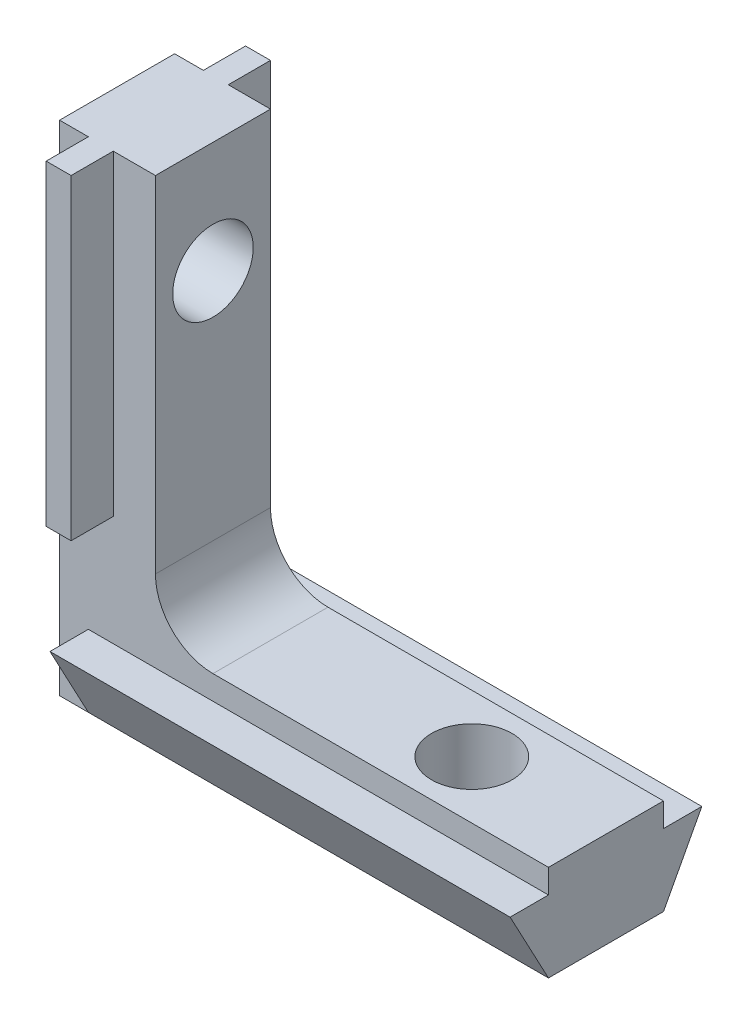
ISO-10303-21;
HEADER;
FILE_DESCRIPTION(('STEP AP214'),'2;1');
FILE_NAME('part.step','',(''),(''),'','','');
FILE_SCHEMA(('AUTOMOTIVE_DESIGN { 1 0 10303 214 1 1 1 1 }'));
ENDSEC;
DATA;
#1=APPLICATION_CONTEXT('core data for automotive mechanical design processes');
#2=APPLICATION_PROTOCOL_DEFINITION('international standard','automotive_design',2000,#1);
#3=PRODUCT_CONTEXT('',#1,'mechanical');
#4=PRODUCT('Part','Part','',(#3));
#5=PRODUCT_RELATED_PRODUCT_CATEGORY('part','',(#4));
#6=PRODUCT_DEFINITION_FORMATION('','',#4);
#7=PRODUCT_DEFINITION_CONTEXT('part definition',#1,'design');
#8=PRODUCT_DEFINITION('design','',#6,#7);
#9=PRODUCT_DEFINITION_SHAPE('','',#8);
#10=(LENGTH_UNIT() NAMED_UNIT(*) SI_UNIT(.MILLI.,.METRE.));
#11=(NAMED_UNIT(*) PLANE_ANGLE_UNIT() SI_UNIT($,.RADIAN.));
#12=(NAMED_UNIT(*) SI_UNIT($,.STERADIAN.) SOLID_ANGLE_UNIT());
#13=UNCERTAINTY_MEASURE_WITH_UNIT(LENGTH_MEASURE(1.E-05),#10,'distance_accuracy_value','');
#14=(GEOMETRIC_REPRESENTATION_CONTEXT(3) GLOBAL_UNCERTAINTY_ASSIGNED_CONTEXT((#13)) GLOBAL_UNIT_ASSIGNED_CONTEXT((#10,
#11,#12)) REPRESENTATION_CONTEXT('',''));
#15=CARTESIAN_POINT('',(0.,0.,0.));
#16=DIRECTION('',(0.,0.,1.));
#17=DIRECTION('',(1.,0.,0.));
#18=AXIS2_PLACEMENT_3D('',#15,#16,#17);
#19=CARTESIAN_POINT('',(5.,26.,3.));
#20=DIRECTION('',(0.,-1.,0.));
#21=DIRECTION('',(0.,0.,-1.));
#22=AXIS2_PLACEMENT_3D('',#19,#20,#21);
#23=PLANE('',#22);
#24=DIRECTION('',(-1.,0.,0.));
#25=VECTOR('',#24,1.);
#26=CARTESIAN_POINT('',(5.,26.,-3.));
#27=LINE('',#26,#25);
#28=CARTESIAN_POINT('',(5.,26.,-3.));
#29=VERTEX_POINT('',#28);
#30=CARTESIAN_POINT('',(2.8,26.,-3.));
#31=VERTEX_POINT('',#30);
#32=EDGE_CURVE('E276',#29,#31,#27,.T.);
#33=ORIENTED_EDGE('',*,*,#32,.T.);
#34=DIRECTION('',(0.,0.,-1.));
#35=VECTOR('',#34,1.);
#36=CARTESIAN_POINT('',(2.8,26.,-5.2));
#37=LINE('',#36,#35);
#38=CARTESIAN_POINT('',(2.8,26.,-5.2));
#39=VERTEX_POINT('',#38);
#40=EDGE_CURVE('E207',#31,#39,#37,.T.);
#41=ORIENTED_EDGE('',*,*,#40,.T.);
#42=DIRECTION('',(-1.,0.,0.));
#43=VECTOR('',#42,1.);
#44=CARTESIAN_POINT('',(1.5,26.,-5.2));
#45=LINE('',#44,#43);
#46=CARTESIAN_POINT('',(1.5,26.,-5.2));
#47=VERTEX_POINT('',#46);
#48=EDGE_CURVE('E180',#39,#47,#45,.T.);
#49=ORIENTED_EDGE('',*,*,#48,.T.);
#50=DIRECTION('',(0.,0.,1.));
#51=VECTOR('',#50,1.);
#52=CARTESIAN_POINT('',(1.5,26.,-5.2));
#53=LINE('',#52,#51);
#54=CARTESIAN_POINT('',(1.5,26.,-3.));
#55=VERTEX_POINT('',#54);
#56=EDGE_CURVE('E203',#47,#55,#53,.T.);
#57=ORIENTED_EDGE('',*,*,#56,.T.);
#58=CARTESIAN_POINT('',(0.,26.,-3.));
#59=VERTEX_POINT('',#58);
#60=EDGE_CURVE('E258',#55,#59,#27,.T.);
#61=ORIENTED_EDGE('',*,*,#60,.T.);
#62=DIRECTION('',(0.,0.,-1.));
#63=VECTOR('',#62,1.);
#64=CARTESIAN_POINT('',(0.,26.,3.));
#65=LINE('',#64,#63);
#66=CARTESIAN_POINT('',(0.,26.,3.));
#67=VERTEX_POINT('',#66);
#68=EDGE_CURVE('E309',#67,#59,#65,.T.);
#69=ORIENTED_EDGE('',*,*,#68,.F.);
#70=DIRECTION('',(-1.,0.,0.));
#71=VECTOR('',#70,1.);
#72=CARTESIAN_POINT('',(5.,26.,3.));
#73=LINE('',#72,#71);
#74=CARTESIAN_POINT('',(1.5,26.,3.));
#75=VERTEX_POINT('',#74);
#76=EDGE_CURVE('E262',#75,#67,#73,.T.);
#77=ORIENTED_EDGE('',*,*,#76,.F.);
#78=CARTESIAN_POINT('',(1.5,26.,5.2));
#79=VERTEX_POINT('',#78);
#80=EDGE_CURVE('E205',#75,#79,#53,.T.);
#81=ORIENTED_EDGE('',*,*,#80,.T.);
#82=DIRECTION('',(1.,0.,0.));
#83=VECTOR('',#82,1.);
#84=CARTESIAN_POINT('',(1.5,26.,5.2));
#85=LINE('',#84,#83);
#86=CARTESIAN_POINT('',(2.8,26.,5.2));
#87=VERTEX_POINT('',#86);
#88=EDGE_CURVE('E187',#79,#87,#85,.T.);
#89=ORIENTED_EDGE('',*,*,#88,.T.);
#90=CARTESIAN_POINT('',(2.8,26.,3.));
#91=VERTEX_POINT('',#90);
#92=EDGE_CURVE('E208',#87,#91,#37,.T.);
#93=ORIENTED_EDGE('',*,*,#92,.T.);
#94=CARTESIAN_POINT('',(5.,26.,3.));
#95=VERTEX_POINT('',#94);
#96=EDGE_CURVE('E259',#95,#91,#73,.T.);
#97=ORIENTED_EDGE('',*,*,#96,.F.);
#98=DIRECTION('',(0.,0.,-1.));
#99=VECTOR('',#98,1.);
#100=CARTESIAN_POINT('',(5.,26.,3.));
#101=LINE('',#100,#99);
#102=EDGE_CURVE('E275',#95,#29,#101,.T.);
#103=ORIENTED_EDGE('',*,*,#102,.T.);
#104=EDGE_LOOP('',(#33,#41,#49,#57,#61,#69,#77,#81,#89,#93,#97,#103));
#105=FACE_BOUND('',#104,.T.);
#106=ADVANCED_FACE('F35',(#105),#23,.F.);
#107=CARTESIAN_POINT('',(0.,26.,3.));
#108=DIRECTION('',(1.,0.,0.));
#109=DIRECTION('',(0.,1.,0.));
#110=AXIS2_PLACEMENT_3D('',#107,#108,#109);
#111=PLANE('',#110);
#112=CARTESIAN_POINT('',(0.,20.2,0.));
#113=DIRECTION('',(1.,0.,0.));
#114=DIRECTION('',(0.,0.,-1.));
#115=AXIS2_PLACEMENT_3D('',#112,#113,#114);
#116=CIRCLE('',#115,2.1);
#117=CARTESIAN_POINT('',(0.,20.2,-2.1));
#118=VERTEX_POINT('',#117);
#119=EDGE_CURVE('E401',#118,#118,#116,.T.);
#120=ORIENTED_EDGE('',*,*,#119,.T.);
#121=EDGE_LOOP('',(#120));
#122=FACE_BOUND('',#121,.T.);
#123=DIRECTION('',(0.,-1.,0.));
#124=VECTOR('',#123,1.);
#125=CARTESIAN_POINT('',(0.,26.,-3.));
#126=LINE('',#125,#124);
#127=CARTESIAN_POINT('',(0.,0.,-3.));
#128=VERTEX_POINT('',#127);
#129=EDGE_CURVE('E279',#59,#128,#126,.T.);
#130=ORIENTED_EDGE('',*,*,#129,.T.);
#131=DIRECTION('',(0.,0.,-1.));
#132=VECTOR('',#131,1.);
#133=CARTESIAN_POINT('',(0.,0.,3.));
#134=LINE('',#133,#132);
#135=CARTESIAN_POINT('',(0.,0.,3.));
#136=VERTEX_POINT('',#135);
#137=EDGE_CURVE('E306',#136,#128,#134,.T.);
#138=ORIENTED_EDGE('',*,*,#137,.F.);
#139=DIRECTION('',(0.,-1.,0.));
#140=VECTOR('',#139,1.);
#141=CARTESIAN_POINT('',(0.,26.,3.));
#142=LINE('',#141,#140);
#143=EDGE_CURVE('E261',#67,#136,#142,.T.);
#144=ORIENTED_EDGE('',*,*,#143,.F.);
#145=ORIENTED_EDGE('',*,*,#68,.T.);
#146=EDGE_LOOP('',(#130,#138,#144,#145));
#147=FACE_BOUND('',#146,.T.);
#148=ADVANCED_FACE('F422',(#122,#147),#111,.F.);
#149=CARTESIAN_POINT('',(0.,0.,3.));
#150=DIRECTION('',(0.,1.,0.));
#151=DIRECTION('',(0.,0.,1.));
#152=AXIS2_PLACEMENT_3D('',#149,#150,#151);
#153=PLANE('',#152);
#154=CARTESIAN_POINT('',(18.5,0.,0.));
#155=DIRECTION('',(0.,1.,0.));
#156=DIRECTION('',(0.,0.,1.));
#157=AXIS2_PLACEMENT_3D('',#154,#155,#156);
#158=CIRCLE('',#157,2.1);
#159=CARTESIAN_POINT('',(18.5,0.,2.1));
#160=VERTEX_POINT('',#159);
#161=EDGE_CURVE('E395',#160,#160,#158,.T.);
#162=ORIENTED_EDGE('',*,*,#161,.T.);
#163=EDGE_LOOP('',(#162));
#164=FACE_BOUND('',#163,.T.);
#165=DIRECTION('',(1.,0.,0.));
#166=VECTOR('',#165,1.);
#167=CARTESIAN_POINT('',(1.5,0.,3.));
#168=LINE('',#167,#166);
#169=CARTESIAN_POINT('',(1.49999999999999,0.,3.));
#170=VERTEX_POINT('',#169);
#171=CARTESIAN_POINT('',(25.5,0.,3.));
#172=VERTEX_POINT('',#171);
#173=EDGE_CURVE('E242',#170,#172,#168,.T.);
#174=ORIENTED_EDGE('',*,*,#173,.F.);
#175=DIRECTION('',(1.,0.,0.));
#176=VECTOR('',#175,1.);
#177=CARTESIAN_POINT('',(0.,0.,3.));
#178=LINE('',#177,#176);
#179=EDGE_CURVE('E264',#136,#170,#178,.T.);
#180=ORIENTED_EDGE('',*,*,#179,.F.);
#181=ORIENTED_EDGE('',*,*,#137,.T.);
#182=DIRECTION('',(1.,0.,0.));
#183=VECTOR('',#182,1.);
#184=CARTESIAN_POINT('',(0.,0.,-3.));
#185=LINE('',#184,#183);
#186=CARTESIAN_POINT('',(1.5,0.,-3.));
#187=VERTEX_POINT('',#186);
#188=EDGE_CURVE('E281',#128,#187,#185,.T.);
#189=ORIENTED_EDGE('',*,*,#188,.T.);
#190=DIRECTION('',(1.,0.,0.));
#191=VECTOR('',#190,1.);
#192=CARTESIAN_POINT('',(1.5,0.,-3.));
#193=LINE('',#192,#191);
#194=CARTESIAN_POINT('',(25.5,0.,-3.));
#195=VERTEX_POINT('',#194);
#196=EDGE_CURVE('E234',#187,#195,#193,.T.);
#197=ORIENTED_EDGE('',*,*,#196,.T.);
#198=DIRECTION('',(0.,0.,-1.));
#199=VECTOR('',#198,1.);
#200=CARTESIAN_POINT('',(25.5,0.,3.));
#201=LINE('',#200,#199);
#202=EDGE_CURVE('E303',#172,#195,#201,.T.);
#203=ORIENTED_EDGE('',*,*,#202,.F.);
#204=EDGE_LOOP('',(#174,#180,#181,#189,#197,#203));
#205=FACE_BOUND('',#204,.T.);
#206=ADVANCED_FACE('F373',(#164,#205),#153,.F.);
#207=CARTESIAN_POINT('',(25.5,0.,3.));
#208=DIRECTION('',(-1.,0.,0.));
#209=DIRECTION('',(0.,0.,1.));
#210=AXIS2_PLACEMENT_3D('',#207,#208,#209);
#211=PLANE('',#210);
#212=DIRECTION('',(0.,1.,0.));
#213=VECTOR('',#212,1.);
#214=CARTESIAN_POINT('',(25.5,0.,3.));
#215=LINE('',#214,#213);
#216=CARTESIAN_POINT('',(25.5,3.75,3.));
#217=VERTEX_POINT('',#216);
#218=CARTESIAN_POINT('',(25.5,5.,3.));
#219=VERTEX_POINT('',#218);
#220=EDGE_CURVE('E267',#217,#219,#215,.T.);
#221=ORIENTED_EDGE('',*,*,#220,.F.);
#222=DIRECTION('',(0.,0.,1.));
#223=VECTOR('',#222,1.);
#224=CARTESIAN_POINT('',(25.5,3.75,5.));
#225=LINE('',#224,#223);
#226=CARTESIAN_POINT('',(25.5,3.75,5.));
#227=VERTEX_POINT('',#226);
#228=EDGE_CURVE('E237',#217,#227,#225,.T.);
#229=ORIENTED_EDGE('',*,*,#228,.T.);
#230=DIRECTION('',(0.,-0.882352941176471,-0.470588235294118));
#231=VECTOR('',#230,1.);
#232=CARTESIAN_POINT('',(25.5,0.,3.));
#233=LINE('',#232,#231);
#234=EDGE_CURVE('E227',#227,#172,#233,.T.);
#235=ORIENTED_EDGE('',*,*,#234,.T.);
#236=ORIENTED_EDGE('',*,*,#202,.T.);
#237=DIRECTION('',(0.,0.882352941176471,-0.470588235294118));
#238=VECTOR('',#237,1.);
#239=CARTESIAN_POINT('',(25.5,0.,-3.));
#240=LINE('',#239,#238);
#241=CARTESIAN_POINT('',(25.5,3.75,-5.));
#242=VERTEX_POINT('',#241);
#243=EDGE_CURVE('E222',#195,#242,#240,.T.);
#244=ORIENTED_EDGE('',*,*,#243,.T.);
#245=CARTESIAN_POINT('',(25.5,3.75,-3.));
#246=VERTEX_POINT('',#245);
#247=EDGE_CURVE('E238',#242,#246,#225,.T.);
#248=ORIENTED_EDGE('',*,*,#247,.T.);
#249=DIRECTION('',(0.,1.,0.));
#250=VECTOR('',#249,1.);
#251=CARTESIAN_POINT('',(25.5,0.,-3.));
#252=LINE('',#251,#250);
#253=CARTESIAN_POINT('',(25.5,5.,-3.));
#254=VERTEX_POINT('',#253);
#255=EDGE_CURVE('E284',#246,#254,#252,.T.);
#256=ORIENTED_EDGE('',*,*,#255,.T.);
#257=DIRECTION('',(0.,0.,-1.));
#258=VECTOR('',#257,1.);
#259=CARTESIAN_POINT('',(25.5,5.,3.));
#260=LINE('',#259,#258);
#261=EDGE_CURVE('E300',#219,#254,#260,.T.);
#262=ORIENTED_EDGE('',*,*,#261,.F.);
#263=EDGE_LOOP('',(#221,#229,#235,#236,#244,#248,#256,#262));
#264=FACE_BOUND('',#263,.T.);
#265=ADVANCED_FACE('F362',(#264),#211,.F.);
#266=CARTESIAN_POINT('',(25.5,5.,3.));
#267=DIRECTION('',(0.,-1.,0.));
#268=DIRECTION('',(1.,0.,0.));
#269=AXIS2_PLACEMENT_3D('',#266,#267,#268);
#270=PLANE('',#269);
#271=CARTESIAN_POINT('',(18.5,5.,0.));
#272=DIRECTION('',(0.,1.,0.));
#273=DIRECTION('',(0.,0.,1.));
#274=AXIS2_PLACEMENT_3D('',#271,#272,#273);
#275=CIRCLE('',#274,2.1);
#276=CARTESIAN_POINT('',(18.5,5.,2.1));
#277=VERTEX_POINT('',#276);
#278=EDGE_CURVE('E397',#277,#277,#275,.T.);
#279=ORIENTED_EDGE('',*,*,#278,.F.);
#280=EDGE_LOOP('',(#279));
#281=FACE_BOUND('',#280,.T.);
#282=DIRECTION('',(-1.,0.,0.));
#283=VECTOR('',#282,1.);
#284=CARTESIAN_POINT('',(25.5,5.,-3.));
#285=LINE('',#284,#283);
#286=CARTESIAN_POINT('',(8.00000000000002,5.,-3.));
#287=VERTEX_POINT('',#286);
#288=EDGE_CURVE('E286',#254,#287,#285,.T.);
#289=ORIENTED_EDGE('',*,*,#288,.T.);
#290=DIRECTION('',(0.,0.,-1.));
#291=VECTOR('',#290,1.);
#292=CARTESIAN_POINT('',(8.00000000000002,5.,3.));
#293=LINE('',#292,#291);
#294=CARTESIAN_POINT('',(8.00000000000002,5.,3.));
#295=VERTEX_POINT('',#294);
#296=EDGE_CURVE('E297',#295,#287,#293,.T.);
#297=ORIENTED_EDGE('',*,*,#296,.F.);
#298=DIRECTION('',(-1.,0.,0.));
#299=VECTOR('',#298,1.);
#300=CARTESIAN_POINT('',(25.5,5.,3.));
#301=LINE('',#300,#299);
#302=EDGE_CURVE('E269',#219,#295,#301,.T.);
#303=ORIENTED_EDGE('',*,*,#302,.F.);
#304=ORIENTED_EDGE('',*,*,#261,.T.);
#305=EDGE_LOOP('',(#289,#297,#303,#304));
#306=FACE_BOUND('',#305,.T.);
#307=ADVANCED_FACE('F357',(#281,#306),#270,.F.);
#308=CARTESIAN_POINT('',(8.,8.,3.));
#309=DIRECTION('',(0.,0.,-1.));
#310=DIRECTION('',(-1.,0.,0.));
#311=AXIS2_PLACEMENT_3D('',#308,#309,#310);
#312=CYLINDRICAL_SURFACE('',#311,3.);
#313=CARTESIAN_POINT('',(8.,8.,-3.));
#314=DIRECTION('',(0.,0.,-1.));
#315=DIRECTION('',(-1.,0.,0.));
#316=AXIS2_PLACEMENT_3D('',#313,#314,#315);
#317=CIRCLE('',#316,3.);
#318=CARTESIAN_POINT('',(5.,8.00000000000002,-3.));
#319=VERTEX_POINT('',#318);
#320=EDGE_CURVE('E288',#287,#319,#317,.T.);
#321=ORIENTED_EDGE('',*,*,#320,.T.);
#322=DIRECTION('',(0.,0.,-1.));
#323=VECTOR('',#322,1.);
#324=CARTESIAN_POINT('',(5.,8.00000000000002,3.));
#325=LINE('',#324,#323);
#326=CARTESIAN_POINT('',(5.,8.00000000000002,3.));
#327=VERTEX_POINT('',#326);
#328=EDGE_CURVE('E294',#327,#319,#325,.T.);
#329=ORIENTED_EDGE('',*,*,#328,.F.);
#330=CARTESIAN_POINT('',(8.,8.,3.));
#331=DIRECTION('',(0.,0.,-1.));
#332=DIRECTION('',(-1.,0.,0.));
#333=AXIS2_PLACEMENT_3D('',#330,#331,#332);
#334=CIRCLE('',#333,3.);
#335=EDGE_CURVE('E271',#295,#327,#334,.T.);
#336=ORIENTED_EDGE('',*,*,#335,.F.);
#337=ORIENTED_EDGE('',*,*,#296,.T.);
#338=EDGE_LOOP('',(#321,#329,#336,#337));
#339=FACE_BOUND('',#338,.T.);
#340=ADVANCED_FACE('F353',(#339),#312,.F.);
#341=CARTESIAN_POINT('',(5.,8.00000000000002,3.));
#342=DIRECTION('',(-1.,0.,0.));
#343=DIRECTION('',(0.,-1.,0.));
#344=AXIS2_PLACEMENT_3D('',#341,#342,#343);
#345=PLANE('',#344);
#346=CARTESIAN_POINT('',(5.,20.2,0.));
#347=DIRECTION('',(1.,0.,0.));
#348=DIRECTION('',(0.,0.,-1.));
#349=AXIS2_PLACEMENT_3D('',#346,#347,#348);
#350=CIRCLE('',#349,2.09999999999999);
#351=CARTESIAN_POINT('',(5.,20.2,-2.09999999999999));
#352=VERTEX_POINT('',#351);
#353=EDGE_CURVE('E406',#352,#352,#350,.T.);
#354=ORIENTED_EDGE('',*,*,#353,.F.);
#355=EDGE_LOOP('',(#354));
#356=FACE_BOUND('',#355,.T.);
#357=DIRECTION('',(0.,1.,0.));
#358=VECTOR('',#357,1.);
#359=CARTESIAN_POINT('',(5.,8.00000000000002,-3.));
#360=LINE('',#359,#358);
#361=EDGE_CURVE('E290',#319,#29,#360,.T.);
#362=ORIENTED_EDGE('',*,*,#361,.T.);
#363=ORIENTED_EDGE('',*,*,#102,.F.);
#364=DIRECTION('',(0.,1.,0.));
#365=VECTOR('',#364,1.);
#366=CARTESIAN_POINT('',(5.,8.00000000000002,3.));
#367=LINE('',#366,#365);
#368=EDGE_CURVE('E273',#327,#95,#367,.T.);
#369=ORIENTED_EDGE('',*,*,#368,.F.);
#370=ORIENTED_EDGE('',*,*,#328,.T.);
#371=EDGE_LOOP('',(#362,#363,#369,#370));
#372=FACE_BOUND('',#371,.T.);
#373=ADVANCED_FACE('F348',(#356,#372),#345,.F.);
#374=CARTESIAN_POINT('',(8.,8.,3.));
#375=DIRECTION('',(0.,0.,-1.));
#376=DIRECTION('',(-1.,0.,0.));
#377=AXIS2_PLACEMENT_3D('',#374,#375,#376);
#378=PLANE('',#377);
#379=DIRECTION('',(1.,0.,0.));
#380=VECTOR('',#379,1.);
#381=CARTESIAN_POINT('',(8.,9.5,3.));
#382=LINE('',#381,#380);
#383=CARTESIAN_POINT('',(1.5,9.5,3.));
#384=VERTEX_POINT('',#383);
#385=CARTESIAN_POINT('',(2.8,9.5,3.));
#386=VERTEX_POINT('',#385);
#387=EDGE_CURVE('E53',#384,#386,#382,.T.);
#388=ORIENTED_EDGE('',*,*,#387,.F.);
#389=DIRECTION('',(0.,1.,0.));
#390=VECTOR('',#389,1.);
#391=CARTESIAN_POINT('',(1.5,8.,3.));
#392=LINE('',#391,#390);
#393=EDGE_CURVE('E176',#384,#75,#392,.T.);
#394=ORIENTED_EDGE('',*,*,#393,.T.);
#395=ORIENTED_EDGE('',*,*,#76,.T.);
#396=ORIENTED_EDGE('',*,*,#143,.T.);
#397=ORIENTED_EDGE('',*,*,#179,.T.);
#398=DIRECTION('',(0.,-1.,0.));
#399=VECTOR('',#398,1.);
#400=CARTESIAN_POINT('',(1.49999999999999,8.,3.));
#401=LINE('',#400,#399);
#402=CARTESIAN_POINT('',(1.49999999999999,3.75,3.));
#403=VERTEX_POINT('',#402);
#404=EDGE_CURVE('E245',#403,#170,#401,.T.);
#405=ORIENTED_EDGE('',*,*,#404,.F.);
#406=DIRECTION('',(1.,0.,0.));
#407=VECTOR('',#406,1.);
#408=CARTESIAN_POINT('',(8.,3.75,3.));
#409=LINE('',#408,#407);
#410=EDGE_CURVE('E255',#403,#217,#409,.T.);
#411=ORIENTED_EDGE('',*,*,#410,.T.);
#412=ORIENTED_EDGE('',*,*,#220,.T.);
#413=ORIENTED_EDGE('',*,*,#302,.T.);
#414=ORIENTED_EDGE('',*,*,#335,.T.);
#415=ORIENTED_EDGE('',*,*,#368,.T.);
#416=ORIENTED_EDGE('',*,*,#96,.T.);
#417=DIRECTION('',(0.,-1.,0.));
#418=VECTOR('',#417,1.);
#419=CARTESIAN_POINT('',(2.8,8.,3.));
#420=LINE('',#419,#418);
#421=EDGE_CURVE('E49',#91,#386,#420,.T.);
#422=ORIENTED_EDGE('',*,*,#421,.T.);
#423=EDGE_LOOP('',(#388,#394,#395,#396,#397,#405,#411,#412,#413,#414,#415,#416,#422));
#424=FACE_BOUND('',#423,.T.);
#425=ADVANCED_FACE('F382',(#424),#378,.F.);
#426=CARTESIAN_POINT('',(8.,8.,-3.));
#427=DIRECTION('',(0.,0.,-1.));
#428=DIRECTION('',(-1.,0.,0.));
#429=AXIS2_PLACEMENT_3D('',#426,#427,#428);
#430=PLANE('',#429);
#431=DIRECTION('',(0.,1.,0.));
#432=VECTOR('',#431,1.);
#433=CARTESIAN_POINT('',(1.5,8.,-3.));
#434=LINE('',#433,#432);
#435=CARTESIAN_POINT('',(1.5,9.5,-3.));
#436=VERTEX_POINT('',#435);
#437=EDGE_CURVE('E11',#436,#55,#434,.T.);
#438=ORIENTED_EDGE('',*,*,#437,.F.);
#439=DIRECTION('',(1.,0.,0.));
#440=VECTOR('',#439,1.);
#441=CARTESIAN_POINT('',(8.,9.5,-3.));
#442=LINE('',#441,#440);
#443=CARTESIAN_POINT('',(2.8,9.5,-3.));
#444=VERTEX_POINT('',#443);
#445=EDGE_CURVE('E318',#436,#444,#442,.T.);
#446=ORIENTED_EDGE('',*,*,#445,.T.);
#447=DIRECTION('',(0.,-1.,0.));
#448=VECTOR('',#447,1.);
#449=CARTESIAN_POINT('',(2.8,8.,-3.));
#450=LINE('',#449,#448);
#451=EDGE_CURVE('E42',#31,#444,#450,.T.);
#452=ORIENTED_EDGE('',*,*,#451,.F.);
#453=ORIENTED_EDGE('',*,*,#32,.F.);
#454=ORIENTED_EDGE('',*,*,#361,.F.);
#455=ORIENTED_EDGE('',*,*,#320,.F.);
#456=ORIENTED_EDGE('',*,*,#288,.F.);
#457=ORIENTED_EDGE('',*,*,#255,.F.);
#458=DIRECTION('',(1.,0.,0.));
#459=VECTOR('',#458,1.);
#460=CARTESIAN_POINT('',(8.,3.75,-3.));
#461=LINE('',#460,#459);
#462=CARTESIAN_POINT('',(1.5,3.75,-3.));
#463=VERTEX_POINT('',#462);
#464=EDGE_CURVE('E315',#463,#246,#461,.T.);
#465=ORIENTED_EDGE('',*,*,#464,.F.);
#466=DIRECTION('',(0.,-1.,0.));
#467=VECTOR('',#466,1.);
#468=CARTESIAN_POINT('',(1.49999999999999,8.,-3.));
#469=LINE('',#468,#467);
#470=EDGE_CURVE('E312',#463,#187,#469,.T.);
#471=ORIENTED_EDGE('',*,*,#470,.T.);
#472=ORIENTED_EDGE('',*,*,#188,.F.);
#473=ORIENTED_EDGE('',*,*,#129,.F.);
#474=ORIENTED_EDGE('',*,*,#60,.F.);
#475=EDGE_LOOP('',(#438,#446,#452,#453,#454,#455,#456,#457,#465,#471,#472,#473,#474));
#476=FACE_BOUND('',#475,.T.);
#477=ADVANCED_FACE('F332',(#476),#430,.T.);
#478=CARTESIAN_POINT('',(1.49999999999999,0.,0.));
#479=DIRECTION('',(1.,0.,0.));
#480=DIRECTION('',(0.,0.,-1.));
#481=AXIS2_PLACEMENT_3D('',#478,#479,#480);
#482=PLANE('',#481);
#483=ORIENTED_EDGE('',*,*,#470,.F.);
#484=DIRECTION('',(0.,0.,1.));
#485=VECTOR('',#484,1.);
#486=CARTESIAN_POINT('',(1.5,3.75,5.));
#487=LINE('',#486,#485);
#488=CARTESIAN_POINT('',(1.5,3.75,-5.));
#489=VERTEX_POINT('',#488);
#490=EDGE_CURVE('E228',#489,#463,#487,.T.);
#491=ORIENTED_EDGE('',*,*,#490,.F.);
#492=DIRECTION('',(0.,0.882352941176471,-0.470588235294118));
#493=VECTOR('',#492,1.);
#494=CARTESIAN_POINT('',(1.5,0.,-3.));
#495=LINE('',#494,#493);
#496=EDGE_CURVE('E223',#187,#489,#495,.T.);
#497=ORIENTED_EDGE('',*,*,#496,.F.);
#498=EDGE_LOOP('',(#483,#491,#497));
#499=FACE_BOUND('',#498,.T.);
#500=ADVANCED_FACE('F369',(#499),#482,.F.);
#501=CARTESIAN_POINT('',(1.5,0.,-3.));
#502=DIRECTION('',(0.,-0.470588235294118,-0.882352941176471));
#503=DIRECTION('',(0.,0.882352941176471,-0.470588235294118));
#504=AXIS2_PLACEMENT_3D('',#501,#502,#503);
#505=PLANE('',#504);
#506=ORIENTED_EDGE('',*,*,#243,.F.);
#507=ORIENTED_EDGE('',*,*,#196,.F.);
#508=ORIENTED_EDGE('',*,*,#496,.T.);
#509=DIRECTION('',(1.,0.,0.));
#510=VECTOR('',#509,1.);
#511=CARTESIAN_POINT('',(1.5,3.75,-5.));
#512=LINE('',#511,#510);
#513=EDGE_CURVE('E249',#489,#242,#512,.T.);
#514=ORIENTED_EDGE('',*,*,#513,.T.);
#515=EDGE_LOOP('',(#506,#507,#508,#514));
#516=FACE_BOUND('',#515,.T.);
#517=ADVANCED_FACE('F371',(#516),#505,.T.);
#518=CARTESIAN_POINT('',(1.5,3.75,5.));
#519=DIRECTION('',(0.,1.,0.));
#520=DIRECTION('',(0.,0.,1.));
#521=AXIS2_PLACEMENT_3D('',#518,#519,#520);
#522=PLANE('',#521);
#523=ORIENTED_EDGE('',*,*,#490,.T.);
#524=ORIENTED_EDGE('',*,*,#464,.T.);
#525=ORIENTED_EDGE('',*,*,#247,.F.);
#526=ORIENTED_EDGE('',*,*,#513,.F.);
#527=EDGE_LOOP('',(#523,#524,#525,#526));
#528=FACE_BOUND('',#527,.T.);
#529=ADVANCED_FACE('F365',(#528),#522,.T.);
#530=ORIENTED_EDGE('',*,*,#410,.F.);
#531=CARTESIAN_POINT('',(1.5,3.75,5.));
#532=VERTEX_POINT('',#531);
#533=EDGE_CURVE('E226',#403,#532,#487,.T.);
#534=ORIENTED_EDGE('',*,*,#533,.T.);
#535=DIRECTION('',(1.,0.,0.));
#536=VECTOR('',#535,1.);
#537=CARTESIAN_POINT('',(1.5,3.75,5.));
#538=LINE('',#537,#536);
#539=EDGE_CURVE('E246',#532,#227,#538,.T.);
#540=ORIENTED_EDGE('',*,*,#539,.T.);
#541=ORIENTED_EDGE('',*,*,#228,.F.);
#542=EDGE_LOOP('',(#530,#534,#540,#541));
#543=FACE_BOUND('',#542,.T.);
#544=ADVANCED_FACE('F390',(#543),#522,.T.);
#545=ORIENTED_EDGE('',*,*,#533,.F.);
#546=ORIENTED_EDGE('',*,*,#404,.T.);
#547=DIRECTION('',(0.,-0.882352941176471,-0.470588235294118));
#548=VECTOR('',#547,1.);
#549=CARTESIAN_POINT('',(1.5,0.,3.));
#550=LINE('',#549,#548);
#551=EDGE_CURVE('E231',#532,#170,#550,.T.);
#552=ORIENTED_EDGE('',*,*,#551,.F.);
#553=EDGE_LOOP('',(#545,#546,#552));
#554=FACE_BOUND('',#553,.T.);
#555=ADVANCED_FACE('F388',(#554),#482,.F.);
#556=CARTESIAN_POINT('',(1.5,0.,3.));
#557=DIRECTION('',(0.,-0.470588235294118,0.88235294117647));
#558=DIRECTION('',(0.,-0.882352941176471,-0.470588235294118));
#559=AXIS2_PLACEMENT_3D('',#556,#557,#558);
#560=PLANE('',#559);
#561=ORIENTED_EDGE('',*,*,#234,.F.);
#562=ORIENTED_EDGE('',*,*,#539,.F.);
#563=ORIENTED_EDGE('',*,*,#551,.T.);
#564=ORIENTED_EDGE('',*,*,#173,.T.);
#565=EDGE_LOOP('',(#561,#562,#563,#564));
#566=FACE_BOUND('',#565,.T.);
#567=ADVANCED_FACE('F379',(#566),#560,.T.);
#568=CARTESIAN_POINT('',(1.5,9.5,-5.2));
#569=DIRECTION('',(0.,0.,-1.));
#570=DIRECTION('',(-1.,0.,0.));
#571=AXIS2_PLACEMENT_3D('',#568,#569,#570);
#572=PLANE('',#571);
#573=ORIENTED_EDGE('',*,*,#48,.F.);
#574=DIRECTION('',(0.,1.,0.));
#575=VECTOR('',#574,1.);
#576=CARTESIAN_POINT('',(2.8,9.5,-5.2));
#577=LINE('',#576,#575);
#578=CARTESIAN_POINT('',(2.8,9.5,-5.2));
#579=VERTEX_POINT('',#578);
#580=EDGE_CURVE('E215',#579,#39,#577,.T.);
#581=ORIENTED_EDGE('',*,*,#580,.F.);
#582=DIRECTION('',(-1.,0.,0.));
#583=VECTOR('',#582,1.);
#584=CARTESIAN_POINT('',(1.5,9.5,-5.2));
#585=LINE('',#584,#583);
#586=CARTESIAN_POINT('',(1.5,9.5,-5.2));
#587=VERTEX_POINT('',#586);
#588=EDGE_CURVE('E189',#579,#587,#585,.T.);
#589=ORIENTED_EDGE('',*,*,#588,.T.);
#590=DIRECTION('',(0.,1.,0.));
#591=VECTOR('',#590,1.);
#592=CARTESIAN_POINT('',(1.5,9.5,-5.2));
#593=LINE('',#592,#591);
#594=EDGE_CURVE('E213',#587,#47,#593,.T.);
#595=ORIENTED_EDGE('',*,*,#594,.T.);
#596=EDGE_LOOP('',(#573,#581,#589,#595));
#597=FACE_BOUND('',#596,.T.);
#598=ADVANCED_FACE('F340',(#597),#572,.T.);
#599=CARTESIAN_POINT('',(0.,9.5,0.));
#600=DIRECTION('',(0.,1.,0.));
#601=DIRECTION('',(0.,0.,1.));
#602=AXIS2_PLACEMENT_3D('',#599,#600,#601);
#603=PLANE('',#602);
#604=ORIENTED_EDGE('',*,*,#445,.F.);
#605=DIRECTION('',(0.,0.,1.));
#606=VECTOR('',#605,1.);
#607=CARTESIAN_POINT('',(1.5,9.5,-5.2));
#608=LINE('',#607,#606);
#609=EDGE_CURVE('E179',#587,#436,#608,.T.);
#610=ORIENTED_EDGE('',*,*,#609,.F.);
#611=ORIENTED_EDGE('',*,*,#588,.F.);
#612=DIRECTION('',(0.,0.,-1.));
#613=VECTOR('',#612,1.);
#614=CARTESIAN_POINT('',(2.8,9.5,-5.2));
#615=LINE('',#614,#613);
#616=EDGE_CURVE('E195',#444,#579,#615,.T.);
#617=ORIENTED_EDGE('',*,*,#616,.F.);
#618=EDGE_LOOP('',(#604,#610,#611,#617));
#619=FACE_BOUND('',#618,.T.);
#620=ADVANCED_FACE('F329',(#619),#603,.F.);
#621=CARTESIAN_POINT('',(2.8,9.5,-5.2));
#622=DIRECTION('',(1.,0.,0.));
#623=DIRECTION('',(0.,0.,-1.));
#624=AXIS2_PLACEMENT_3D('',#621,#622,#623);
#625=PLANE('',#624);
#626=ORIENTED_EDGE('',*,*,#40,.F.);
#627=ORIENTED_EDGE('',*,*,#451,.T.);
#628=ORIENTED_EDGE('',*,*,#616,.T.);
#629=ORIENTED_EDGE('',*,*,#580,.T.);
#630=EDGE_LOOP('',(#626,#627,#628,#629));
#631=FACE_BOUND('',#630,.T.);
#632=ADVANCED_FACE('F323',(#631),#625,.T.);
#633=CARTESIAN_POINT('',(1.5,9.5,-5.2));
#634=DIRECTION('',(-1.,0.,0.));
#635=DIRECTION('',(0.,0.,1.));
#636=AXIS2_PLACEMENT_3D('',#633,#634,#635);
#637=PLANE('',#636);
#638=ORIENTED_EDGE('',*,*,#609,.T.);
#639=ORIENTED_EDGE('',*,*,#437,.T.);
#640=ORIENTED_EDGE('',*,*,#56,.F.);
#641=ORIENTED_EDGE('',*,*,#594,.F.);
#642=EDGE_LOOP('',(#638,#639,#640,#641));
#643=FACE_BOUND('',#642,.T.);
#644=ADVANCED_FACE('F337',(#643),#637,.T.);
#645=ORIENTED_EDGE('',*,*,#393,.F.);
#646=CARTESIAN_POINT('',(1.5,9.5,5.2));
#647=VERTEX_POINT('',#646);
#648=EDGE_CURVE('E170',#384,#647,#608,.T.);
#649=ORIENTED_EDGE('',*,*,#648,.T.);
#650=DIRECTION('',(0.,1.,0.));
#651=VECTOR('',#650,1.);
#652=CARTESIAN_POINT('',(1.5,9.5,5.2));
#653=LINE('',#652,#651);
#654=EDGE_CURVE('E174',#647,#79,#653,.T.);
#655=ORIENTED_EDGE('',*,*,#654,.T.);
#656=ORIENTED_EDGE('',*,*,#80,.F.);
#657=EDGE_LOOP('',(#645,#649,#655,#656));
#658=FACE_BOUND('',#657,.T.);
#659=ADVANCED_FACE('F172',(#658),#637,.T.);
#660=ORIENTED_EDGE('',*,*,#421,.F.);
#661=ORIENTED_EDGE('',*,*,#92,.F.);
#662=DIRECTION('',(0.,1.,0.));
#663=VECTOR('',#662,1.);
#664=CARTESIAN_POINT('',(2.8,9.5,5.2));
#665=LINE('',#664,#663);
#666=CARTESIAN_POINT('',(2.8,9.5,5.2));
#667=VERTEX_POINT('',#666);
#668=EDGE_CURVE('E188',#667,#87,#665,.T.);
#669=ORIENTED_EDGE('',*,*,#668,.F.);
#670=EDGE_CURVE('E194',#667,#386,#615,.T.);
#671=ORIENTED_EDGE('',*,*,#670,.T.);
#672=EDGE_LOOP('',(#660,#661,#669,#671));
#673=FACE_BOUND('',#672,.T.);
#674=ADVANCED_FACE('F393',(#673),#625,.T.);
#675=ORIENTED_EDGE('',*,*,#648,.F.);
#676=ORIENTED_EDGE('',*,*,#387,.T.);
#677=ORIENTED_EDGE('',*,*,#670,.F.);
#678=DIRECTION('',(1.,0.,0.));
#679=VECTOR('',#678,1.);
#680=CARTESIAN_POINT('',(1.5,9.5,5.2));
#681=LINE('',#680,#679);
#682=EDGE_CURVE('E185',#647,#667,#681,.T.);
#683=ORIENTED_EDGE('',*,*,#682,.F.);
#684=EDGE_LOOP('',(#675,#676,#677,#683));
#685=FACE_BOUND('',#684,.T.);
#686=ADVANCED_FACE('F192',(#685),#603,.F.);
#687=CARTESIAN_POINT('',(1.5,9.5,5.2));
#688=DIRECTION('',(0.,0.,1.));
#689=DIRECTION('',(1.,0.,0.));
#690=AXIS2_PLACEMENT_3D('',#687,#688,#689);
#691=PLANE('',#690);
#692=ORIENTED_EDGE('',*,*,#88,.F.);
#693=ORIENTED_EDGE('',*,*,#654,.F.);
#694=ORIENTED_EDGE('',*,*,#682,.T.);
#695=ORIENTED_EDGE('',*,*,#668,.T.);
#696=EDGE_LOOP('',(#692,#693,#694,#695));
#697=FACE_BOUND('',#696,.T.);
#698=ADVANCED_FACE('F184',(#697),#691,.T.);
#699=CARTESIAN_POINT('',(18.5,5.,0.));
#700=DIRECTION('',(0.,1.,0.));
#701=DIRECTION('',(0.,0.,1.));
#702=AXIS2_PLACEMENT_3D('',#699,#700,#701);
#703=CYLINDRICAL_SURFACE('',#702,2.1);
#704=ORIENTED_EDGE('',*,*,#161,.F.);
#705=EDGE_LOOP('',(#704));
#706=FACE_BOUND('',#705,.T.);
#707=ORIENTED_EDGE('',*,*,#278,.T.);
#708=EDGE_LOOP('',(#707));
#709=FACE_BOUND('',#708,.T.);
#710=ADVANCED_FACE('F441',(#706,#709),#703,.F.);
#711=CARTESIAN_POINT('',(5.,20.2,0.));
#712=DIRECTION('',(1.,0.,0.));
#713=DIRECTION('',(0.,0.,-1.));
#714=AXIS2_PLACEMENT_3D('',#711,#712,#713);
#715=CYLINDRICAL_SURFACE('',#714,2.09999999999999);
#716=ORIENTED_EDGE('',*,*,#119,.F.);
#717=EDGE_LOOP('',(#716));
#718=FACE_BOUND('',#717,.T.);
#719=ORIENTED_EDGE('',*,*,#353,.T.);
#720=EDGE_LOOP('',(#719));
#721=FACE_BOUND('',#720,.T.);
#722=ADVANCED_FACE('F410',(#718,#721),#715,.F.);
#723=CLOSED_SHELL('',(#106,#148,#206,#265,#307,#340,#373,#425,#477,#500,#517,#529,#544,#555,
#567,#598,#620,#632,#644,#659,#674,#686,#698,#710,#722));
#724=MANIFOLD_SOLID_BREP('B2',#723);
#725=ADVANCED_BREP_SHAPE_REPRESENTATION('',(#18,#724),#14);
#726=SHAPE_DEFINITION_REPRESENTATION(#9,#725);
ENDSEC;
END-ISO-10303-21;
